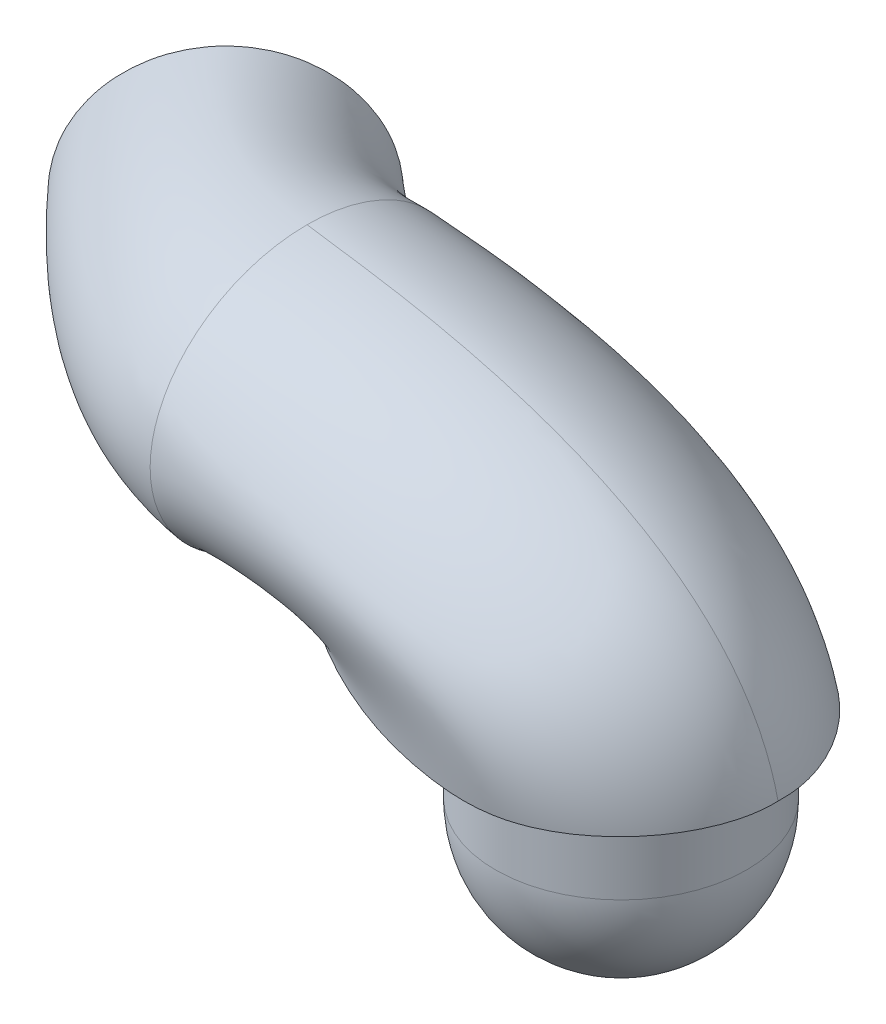
ISO-10303-21;
HEADER;
FILE_DESCRIPTION(('STEP AP214'),'2;1');
FILE_NAME('part.step','',(''),(''),'','','');
FILE_SCHEMA(('AUTOMOTIVE_DESIGN { 1 0 10303 214 1 1 1 1 }'));
ENDSEC;
DATA;
#1=APPLICATION_CONTEXT('core data for automotive mechanical design processes');
#2=APPLICATION_PROTOCOL_DEFINITION('international standard','automotive_design',2000,#1);
#3=PRODUCT_CONTEXT('',#1,'mechanical');
#4=PRODUCT('Part','Part','',(#3));
#5=PRODUCT_RELATED_PRODUCT_CATEGORY('part','',(#4));
#6=PRODUCT_DEFINITION_FORMATION('','',#4);
#7=PRODUCT_DEFINITION_CONTEXT('part definition',#1,'design');
#8=PRODUCT_DEFINITION('design','',#6,#7);
#9=PRODUCT_DEFINITION_SHAPE('','',#8);
#10=(LENGTH_UNIT() NAMED_UNIT(*) SI_UNIT(.MILLI.,.METRE.));
#11=(NAMED_UNIT(*) PLANE_ANGLE_UNIT() SI_UNIT($,.RADIAN.));
#12=(NAMED_UNIT(*) SI_UNIT($,.STERADIAN.) SOLID_ANGLE_UNIT());
#13=UNCERTAINTY_MEASURE_WITH_UNIT(LENGTH_MEASURE(1.E-05),#10,'distance_accuracy_value','');
#14=(GEOMETRIC_REPRESENTATION_CONTEXT(3) GLOBAL_UNCERTAINTY_ASSIGNED_CONTEXT((#13)) GLOBAL_UNIT_ASSIGNED_CONTEXT((#10,
#11,#12)) REPRESENTATION_CONTEXT('',''));
#15=CARTESIAN_POINT('',(0.,0.,0.));
#16=DIRECTION('',(0.,0.,1.));
#17=DIRECTION('',(1.,0.,0.));
#18=AXIS2_PLACEMENT_3D('',#15,#16,#17);
#19=CARTESIAN_POINT('',(4.73507473245652,0.,4.98936116941505));
#20=DIRECTION('',(0.,-1.,0.));
#21=DIRECTION('',(0.,0.,-1.));
#22=AXIS2_PLACEMENT_3D('',#19,#20,#21);
#23=PLANE('',#22);
#24=CARTESIAN_POINT('',(5.,0.,2.5));
#25=DIRECTION('',(0.,-1.,0.));
#26=DIRECTION('',(0.,0.,-1.));
#27=AXIS2_PLACEMENT_3D('',#24,#25,#26);
#28=CIRCLE('',#27,2.);
#29=CARTESIAN_POINT('',(3.06350832689629,0.,2.));
#30=VERTEX_POINT('',#29);
#31=CARTESIAN_POINT('',(3.06350832689629,0.,3.));
#32=VERTEX_POINT('',#31);
#33=EDGE_CURVE('E239',#30,#32,#28,.T.);
#34=ORIENTED_EDGE('',*,*,#33,.F.);
#35=DIRECTION('',(-1.,0.,0.));
#36=VECTOR('',#35,1.);
#37=CARTESIAN_POINT('',(4.44098300562505,0.,2.));
#38=LINE('',#37,#36);
#39=CARTESIAN_POINT('',(4.44098300562505,0.,2.));
#40=VERTEX_POINT('',#39);
#41=EDGE_CURVE('E219',#40,#30,#38,.T.);
#42=ORIENTED_EDGE('',*,*,#41,.F.);
#43=CARTESIAN_POINT('',(5.,0.,2.5));
#44=DIRECTION('',(0.,1.,0.));
#45=DIRECTION('',(0.,0.,1.));
#46=AXIS2_PLACEMENT_3D('',#43,#44,#45);
#47=CIRCLE('',#46,0.75);
#48=CARTESIAN_POINT('',(4.44098300562505,0.,3.));
#49=VERTEX_POINT('',#48);
#50=EDGE_CURVE('E214',#49,#40,#47,.T.);
#51=ORIENTED_EDGE('',*,*,#50,.F.);
#52=DIRECTION('',(1.,0.,0.));
#53=VECTOR('',#52,1.);
#54=CARTESIAN_POINT('',(2.6790228958727,0.,3.));
#55=LINE('',#54,#53);
#56=EDGE_CURVE('E222',#32,#49,#55,.T.);
#57=ORIENTED_EDGE('',*,*,#56,.F.);
#58=EDGE_LOOP('',(#34,#42,#51,#57));
#59=FACE_BOUND('',#58,.T.);
#60=CARTESIAN_POINT('',(0.,0.,2.5));
#61=CARTESIAN_POINT('',(0.293338087820461,0.,2.82795129944699));
#62=CARTESIAN_POINT('',(0.969478991949337,0.,3.47175607058277));
#63=CARTESIAN_POINT('',(2.0225358724664,0.,4.15441549125842));
#64=CARTESIAN_POINT('',(2.93444095803466,0.,4.56768487752718));
#65=CARTESIAN_POINT('',(3.63304559323961,0.,4.80332689979681));
#66=CARTESIAN_POINT('',(4.32877073926575,0.,4.95378775654363));
#67=CARTESIAN_POINT('',(4.78000040421905,0.,5.));
#68=CARTESIAN_POINT('',(5.1817895453393,0.,5.));
#69=CARTESIAN_POINT('',(5.52857314560845,0.,4.96506001367999));
#70=CARTESIAN_POINT('',(5.99170763089045,0.,4.79874490778828));
#71=CARTESIAN_POINT('',(6.39822178057757,0.,4.55577936255793));
#72=CARTESIAN_POINT('',(6.86621771406725,0.,4.14920933028272));
#73=CARTESIAN_POINT('',(7.23330123988562,0.,3.64143178730474));
#74=CARTESIAN_POINT('',(7.46344380636916,0.,3.02850424136115));
#75=CARTESIAN_POINT('',(7.50823058996346,0.,2.68160312823165));
#76=CARTESIAN_POINT('',(7.5,0.,2.49999999999999));
#77=B_SPLINE_CURVE_WITH_KNOTS('',3,(#60,#61,#62,#63,#64,#65,#66,#67,#68,#69,#70,#71,#72,#73,#74,
#75,#76),.UNSPECIFIED.,.F.,.F.,(4,1,1,1,1,1,2,1,1,1,1,1,1,4),(0.,0.136887448758295,
0.273774897516589,0.342218621895737,0.410662346274884,0.479106070654031,0.547549795033178,
0.604106070654031,0.660662346274884,0.717218621895737,0.773774897516589,0.886887448758295,
0.943443724379147,1.),.UNSPECIFIED.);
#78=CARTESIAN_POINT('',(0.,-1.2928250840123E-08,2.49971507284762));
#79=VERTEX_POINT('',#78);
#80=CARTESIAN_POINT('',(7.5,0.,2.5));
#81=VERTEX_POINT('',#80);
#82=EDGE_CURVE('E251',#79,#81,#77,.T.);
#83=ORIENTED_EDGE('',*,*,#82,.F.);
#84=CARTESIAN_POINT('',(7.5,0.,2.50000000000001));
#85=CARTESIAN_POINT('',(7.50823058917349,0.,2.31839688919857));
#86=CARTESIAN_POINT('',(7.46344381568126,0.,1.97149579834312));
#87=CARTESIAN_POINT('',(7.23330125921473,0.,1.35856824306579));
#88=CARTESIAN_POINT('',(6.86621772138046,0.,0.850790673414314));
#89=CARTESIAN_POINT('',(6.39822176321519,0.,0.444220623691196));
#90=CARTESIAN_POINT('',(5.99170759816834,0.,0.201255075385112));
#91=CARTESIAN_POINT('',(5.52857310613618,0.,0.0349399784608431));
#92=CARTESIAN_POINT('',(5.18178952789119,0.,0.));
#93=CARTESIAN_POINT('',(4.78000039221216,0.,0.));
#94=CARTESIAN_POINT('',(4.3287706849955,0.,0.0462122499199591));
#95=CARTESIAN_POINT('',(3.63304553826115,0.,0.196673117505334));
#96=CARTESIAN_POINT('',(2.93444092301905,0.,0.432315135350582));
#97=CARTESIAN_POINT('',(2.0225358825626,0.,0.845584510287323));
#98=CARTESIAN_POINT('',(0.96947906081587,0.,1.52824387361764));
#99=CARTESIAN_POINT('',(0.293338103829924,0.,2.17204868265447));
#100=CARTESIAN_POINT('',(0.,0.,2.5));
#101=B_SPLINE_CURVE_WITH_KNOTS('',3,(#84,#85,#86,#87,#88,#89,#90,#91,#92,#93,#94,#95,#96,#97,
#98,#99,#100),.UNSPECIFIED.,.F.,.F.,(4,1,1,1,1,1,1,2,1,1,1,1,1,4),(0.,0.0565562694304325,
0.113112538860865,0.226225077721729,0.282781347152162,0.339337616582594,0.395893886013026,
0.452450155443459,0.520893886013026,0.589337616582594,0.657781347152162,0.726225077721729,
0.863112538860865,1.),.UNSPECIFIED.);
#102=EDGE_CURVE('E245',#81,#79,#101,.T.);
#103=ORIENTED_EDGE('',*,*,#102,.F.);
#104=EDGE_LOOP('',(#83,#103));
#105=FACE_BOUND('',#104,.T.);
#106=ADVANCED_FACE('F154',(#59,#105),#23,.T.);
#107=CARTESIAN_POINT('',(-3.31225624165787,2.,0.483829116911674));
#108=DIRECTION('',(0.707106781186546,0.,0.707106781186549));
#109=DIRECTION('',(0.707106781186549,0.,-0.707106781186546));
#110=AXIS2_PLACEMENT_3D('',#107,#108,#109);
#111=PLANE('',#110);
#112=CARTESIAN_POINT('',(-3.31225624165787,2.,0.483829116911674));
#113=DIRECTION('',(0.707106781186546,0.,0.707106781186549));
#114=DIRECTION('',(-0.707106781186549,0.,0.707106781186546));
#115=AXIS2_PLACEMENT_3D('',#112,#113,#114);
#116=ELLIPSE('',#115,2.,2.);
#117=CARTESIAN_POINT('',(-4.72646980403097,2.,1.89804267928477));
#118=VERTEX_POINT('',#117);
#119=EDGE_CURVE('E382',#118,#118,#116,.T.);
#120=ORIENTED_EDGE('',*,*,#119,.F.);
#121=EDGE_LOOP('',(#120));
#122=FACE_BOUND('',#121,.T.);
#123=CARTESIAN_POINT('',(-3.31225624165787,2.,0.483829116911674));
#124=DIRECTION('',(0.707106781186546,0.,0.707106781186549));
#125=DIRECTION('',(0.707106781186549,0.,-0.707106781186546));
#126=AXIS2_PLACEMENT_3D('',#123,#124,#125);
#127=CIRCLE('',#126,1.125);
#128=CARTESIAN_POINT('',(-2.516761112823,2.,-0.31166601192319));
#129=VERTEX_POINT('',#128);
#130=EDGE_CURVE('E246',#129,#129,#127,.T.);
#131=ORIENTED_EDGE('',*,*,#130,.T.);
#132=EDGE_LOOP('',(#131));
#133=FACE_BOUND('',#132,.T.);
#134=ADVANCED_FACE('F325',(#122,#133),#111,.F.);
#135=CARTESIAN_POINT('',(0.,4.2,2.49999997011014));
#136=CARTESIAN_POINT('',(-0.146742611688297,4.20286550461975,2.48179723035606));
#137=CARTESIAN_POINT('',(-1.12222066506903,4.1789003750892,2.30069532329818));
#138=CARTESIAN_POINT('',(-1.95948753838525,4.17445859906967,2.03247373475735));
#139=CARTESIAN_POINT('',(-3.31225624165787,4.,0.483829116911673));
#140=CARTESIAN_POINT('',(0.,4.2,2.19836129227853));
#141=CARTESIAN_POINT('',(-0.139655756541813,4.20286550461975,2.18406290197288));
#142=CARTESIAN_POINT('',(-1.04755878022122,4.1789003750892,2.04365442456356));
#143=CARTESIAN_POINT('',(-1.82449953616029,4.17445859906967,1.8156706481727));
#144=CARTESIAN_POINT('',(-3.12713612960674,4.,0.298709004860543));
#145=CARTESIAN_POINT('',(0.,4.10833507935549,1.59472909886228));
#146=CARTESIAN_POINT('',(-0.120973982876845,4.11002144089427,1.58594662839158));
#147=CARTESIAN_POINT('',(-0.904573863692059,4.08061234565118,1.50178683907874));
#148=CARTESIAN_POINT('',(-1.55258827534835,4.06638287744619,1.33493326701403));
#149=CARTESIAN_POINT('',(-2.75696375909292,3.89598215796163,-0.0714633656532701));
#150=CARTESIAN_POINT('',(0.,3.69371629660239,0.776500214039875));
#151=CARTESIAN_POINT('',(-0.0893458189282706,3.69209060756782,0.772432772687611));
#152=CARTESIAN_POINT('',(-0.733092205662598,3.64860340188294,0.733123212621852));
#153=CARTESIAN_POINT('',(-1.20291843988814,3.6072646438174,0.627302127550897));
#154=CARTESIAN_POINT('',(-2.2861976535332,3.45106597111442,-0.542229471213002));
#155=CARTESIAN_POINT('',(0.,3.00272511026058,0.160766285967962));
#156=CARTESIAN_POINT('',(-0.063610221964274,2.99963819662749,0.159854172326594));
#157=CARTESIAN_POINT('',(-0.623958643141196,2.96058114025006,0.148560376060056));
#158=CARTESIAN_POINT('',(-0.966615544216336,2.91064135207322,0.0872790256589414));
#159=CARTESIAN_POINT('',(-1.97159440075428,2.78530215992626,-0.856832723991904));
#160=CARTESIAN_POINT('',(0.,2.40163870772189,0.));
#161=CARTESIAN_POINT('',(-0.0561900803845833,2.40037053557888,-0.000301631636904407));
#162=CARTESIAN_POINT('',(-0.599911396905172,2.38584835920112,-0.00687602085754774));
#163=CARTESIAN_POINT('',(-0.910444623419121,2.35609972455105,-0.0578730217352386));
#164=CARTESIAN_POINT('',(-1.89804267928477,2.26179937313036,-0.930384445461419));
#165=CARTESIAN_POINT('',(0.,1.7983613221811,0.));
#166=CARTESIAN_POINT('',(-0.0561900803845833,1.79974910381625,-0.000301631636904211));
#167=CARTESIAN_POINT('',(-0.599911396905172,1.81178646522161,-0.00687602085754752));
#168=CARTESIAN_POINT('',(-0.910444623419121,1.80859736835465,-0.0578730217352383));
#169=CARTESIAN_POINT('',(-1.89804267928477,1.73820060093892,-0.930384445461418));
#170=CARTESIAN_POINT('',(0.,1.19727492933299,0.160766259464055));
#171=CARTESIAN_POINT('',(-0.0548917199946969,1.20082468843853,0.162729750023182));
#172=CARTESIAN_POINT('',(-0.593725373143239,1.2347118814175,0.171075370974304));
#173=CARTESIAN_POINT('',(-0.973911339668054,1.25527592340819,0.0503136387346895));
#174=CARTESIAN_POINT('',(-1.97159441350193,1.21469780349391,-0.856832711244266));
#175=CARTESIAN_POINT('',(0.,0.506283697054256,0.776500209636346));
#176=CARTESIAN_POINT('',(-0.054471809498738,0.509401944448522,0.783935180112972));
#177=CARTESIAN_POINT('',(-0.61215910848492,0.539664190919537,0.823183239125599));
#178=CARTESIAN_POINT('',(-1.23210158860519,0.56231320825439,0.479440576925317));
#179=CARTESIAN_POINT('',(-2.28619765696574,0.548934033738167,-0.542229467780446));
#180=CARTESIAN_POINT('',(0.,0.0916649048201302,1.5947291423194));
#181=CARTESIAN_POINT('',(-0.0599444653893786,0.0925008123711799,1.60607588977972));
#182=CARTESIAN_POINT('',(-0.692940932512134,0.100629831013785,1.6593919060208));
#183=CARTESIAN_POINT('',(-1.60365876374493,0.106855542372347,1.07617554618459));
#184=CARTESIAN_POINT('',(-2.75696373322839,0.104017860065657,-0.0714633915178119));
#185=CARTESIAN_POINT('',(0.,0.,2.1983613221807));
#186=CARTESIAN_POINT('',(-0.0699077370469979,0.,2.20706775339796));
#187=CARTESIAN_POINT('',(-0.805692578138338,0.,2.2237744924289));
#188=CARTESIAN_POINT('',(-1.88286581715893,0.,1.51994754016445));
#189=CARTESIAN_POINT('',(-3.12713611127149,0.,0.298708986525293));
#190=CARTESIAN_POINT('',(0.,0.,2.80163870772319));
#191=CARTESIAN_POINT('',(-0.0840814480419639,0.,2.80253643965677));
#192=CARTESIAN_POINT('',(-0.955016355229448,0.,2.73785631535882));
#193=CARTESIAN_POINT('',(-2.15284183497922,0.,1.95355373480779));
#194=CARTESIAN_POINT('',(-3.49737635370901,0.,0.668949228962813));
#195=CARTESIAN_POINT('',(0.,0.0916649206455884,3.4052709011433));
#196=CARTESIAN_POINT('',(-0.0875872606806623,0.0924571178085326,3.40131011932424));
#197=CARTESIAN_POINT('',(-0.977480993420405,0.100186966034652,3.29493919639107));
#198=CARTESIAN_POINT('',(-2.32620520636502,0.107938520074303,2.5310945458628));
#199=CARTESIAN_POINT('',(-3.86754872422255,0.104017842038337,1.03912159947635));
#200=CARTESIAN_POINT('',(0.,0.506283703404131,4.22349978597012));
#201=CARTESIAN_POINT('',(-0.0736875415503121,0.509227113386236,4.21679619327979));
#202=CARTESIAN_POINT('',(-0.787401816434423,0.53789271959392,4.10924870948619));
#203=CARTESIAN_POINT('',(-2.38023137354631,0.566645149055742,3.52913597501362));
#204=CARTESIAN_POINT('',(-4.33831482978188,0.548934028884766,1.50988770503568));
#205=CARTESIAN_POINT('',(0.,1.19727488975452,4.83923371404141));
#206=CARTESIAN_POINT('',(-0.0538952554353766,1.20051868658087,4.83134701188757));
#207=CARTESIAN_POINT('',(-0.534974543940408,1.23161179101987,4.73945743268341));
#208=CARTESIAN_POINT('',(-2.32089060093949,1.26285683615362,4.3595693665924));
#209=CARTESIAN_POINT('',(-4.65291808256107,1.21469784007231,1.82449095781486));
#210=CARTESIAN_POINT('',(0.,1.79836129229778,5.00000000000351));
#211=CARTESIAN_POINT('',(-0.0461394359887617,1.79939940171593,4.99216022192788));
#212=CARTESIAN_POINT('',(-0.438501511838035,1.80824350866791,4.91010912514281));
#213=CARTESIAN_POINT('',(-2.27851363231067,1.81726126212817,4.60152484388083));
#214=CARTESIAN_POINT('',(-4.72646980403097,1.73820062686889,1.89804267928477));
#215=CARTESIAN_POINT('',(0.,2.40163867783856,4.99999999999649));
#216=CARTESIAN_POINT('',(-0.0461394359887617,2.40002083347856,4.99216022192112));
#217=CARTESIAN_POINT('',(-0.438501511838035,2.38230540264743,4.91010912513858));
#218=CARTESIAN_POINT('',(-2.27851363231067,2.36476361832457,4.60152484387891));
#219=CARTESIAN_POINT('',(-4.72646980403097,2.26179939906034,1.89804267928477));
#220=CARTESIAN_POINT('',(0.,3.00272507068211,4.83923374052658));
#221=CARTESIAN_POINT('',(-0.0626137574049408,2.99933219476982,4.82847143417294));
#222=CARTESIAN_POINT('',(-0.565207813938365,2.95748104985242,4.71694243775809));
#223=CARTESIAN_POINT('',(-2.31359480548809,2.91822226481865,4.3965347535121));
#224=CARTESIAN_POINT('',(-4.65291806981422,2.78530219650464,1.82449094506801));
#225=CARTESIAN_POINT('',(0.,3.69371630295224,4.22349979035368));
#226=CARTESIAN_POINT('',(-0.108561550979761,3.69191577650552,4.20529378583522));
#227=CARTESIAN_POINT('',(-0.908334913611638,3.64683193055731,4.01918868297089));
#228=CARTESIAN_POINT('',(-2.35104822482944,3.61159658461875,3.67699752563491));
#229=CARTESIAN_POINT('',(-4.33831482635066,3.45106596626102,1.50988770160447));
#230=CARTESIAN_POINT('',(0.,4.10833509518095,3.40527085767503));
#231=CARTESIAN_POINT('',(-0.148616778167991,4.10997774633162,3.38118085792536));
#232=CARTESIAN_POINT('',(-1.18911392459937,4.08016948067204,3.13733412944258));
#233=CARTESIAN_POINT('',(-2.2751347179679,4.06746585514814,2.78985226668994));
#234=CARTESIAN_POINT('',(-3.86754875008765,3.8959821399343,1.03912162534144));
#235=CARTESIAN_POINT('',(0.,4.2,2.80163867781761));
#236=CARTESIAN_POINT('',(-0.1538294675367,4.20286550461975,2.77953158822839));
#237=CARTESIAN_POINT('',(-1.19688255731175,4.1789003750892,2.55773624749147));
#238=CARTESIAN_POINT('',(-2.09447555398012,4.17445859906967,2.2492768428153));
#239=CARTESIAN_POINT('',(-3.49737637204426,4.,0.668949247298062));
#240=CARTESIAN_POINT('',(0.,4.2,2.49999997011014));
#241=CARTESIAN_POINT('',(-0.146742611688297,4.20286550461975,2.48179723035606));
#242=CARTESIAN_POINT('',(-1.12222066506903,4.1789003750892,2.30069532329818));
#243=CARTESIAN_POINT('',(-1.95948753838525,4.17445859906967,2.03247373475735));
#244=CARTESIAN_POINT('',(-3.31225624165787,4.,0.483829116911673));
#245=B_SPLINE_SURFACE_WITH_KNOTS('',3,3,((#135,#136,#137,#138,#139),(#140,#141,#142,#143,#144),
(#145,#146,#147,#148,#149),(#150,#151,#152,#153,#154),(#155,#156,#157,#158,#159),(#160,#161,
#162,#163,#164),(#165,#166,#167,#168,#169),(#170,#171,#172,#173,#174),(#175,#176,#177,#178,
#179),(#180,#181,#182,#183,#184),(#185,#186,#187,#188,#189),(#190,#191,#192,#193,#194),(#195,
#196,#197,#198,#199),(#200,#201,#202,#203,#204),(#205,#206,#207,#208,#209),(#210,#211,#212,#213,
#214),(#215,#216,#217,#218,#219),(#220,#221,#222,#223,#224),(#225,#226,#227,#228,#229),(#230,
#231,#232,#233,#234),(#235,#236,#237,#238,#239),(#240,#241,#242,#243,#244)),.UNSPECIFIED.,.T.,
.F.,.F.,(4,1,1,1,2,1,1,1,2,1,1,1,2,1,1,1,4),(4,1,4),(0.,0.0624999969047489,0.124999993809498,
0.187499990714247,0.249999987618996,0.312499990714247,0.374999993809498,0.437499996904749,
0.500000000000001,0.562499996904927,0.624999993809853,0.687499990714779,0.749999987619705,
0.812499990714778,0.874999993809852,0.937499996904926,1.),(0.,0.0999999999941863,1.),.UNSPECIFIED.);
#246=CARTESIAN_POINT('',(0.,2.1,2.5));
#247=DIRECTION('',(1.,0.,0.));
#248=DIRECTION('',(0.,0.,-1.));
#249=AXIS2_PLACEMENT_3D('',#246,#247,#248);
#250=ELLIPSE('',#249,2.5,2.1);
#251=CARTESIAN_POINT('',(0.,4.2,2.49999998505507));
#252=VERTEX_POINT('',#251);
#253=EDGE_CURVE('E183',#252,#79,#250,.T.);
#254=CARTESIAN_POINT('',(0.,0.,2.50000000001222));
#255=CARTESIAN_POINT('',(0.,-1.35784116987904E-12,2.16967559403792));
#256=CARTESIAN_POINT('',(0.,0.105883210677071,1.55884618883736));
#257=CARTESIAN_POINT('',(0.,0.443578776925178,0.909399669526774));
#258=CARTESIAN_POINT('',(0.,0.837871906372763,0.481899893110981));
#259=CARTESIAN_POINT('',(0.,1.19638423191904,0.22413777234123));
#260=CARTESIAN_POINT('',(0.,1.61841317616196,0.0460723551393264));
#261=CARTESIAN_POINT('',(0.,1.93483779701285,0.));
#262=CARTESIAN_POINT('',(0.,2.23647648694374,0.));
#263=CARTESIAN_POINT('',(0.,2.51924998343517,0.0332371478353647));
#264=CARTESIAN_POINT('',(0.,2.94130300614817,0.187749965087625));
#265=CARTESIAN_POINT('',(0.,3.329680017001,0.451865529832219));
#266=CARTESIAN_POINT('',(0.,3.77181354724044,0.916256667810958));
#267=CARTESIAN_POINT('',(0.,4.05419164850725,1.49815346576288));
#268=CARTESIAN_POINT('',(0.,4.18119654345599,2.08119218589711));
#269=CARTESIAN_POINT('',(0.,4.2,2.36352351305626));
#270=CARTESIAN_POINT('',(0.,4.2,2.5));
#271=B_SPLINE_CURVE_WITH_KNOTS('',3,(#254,#255,#256,#257,#258,#259,#260,#261,#262,#263,#264,
#265,#266,#267,#268,#269,#270),.UNSPECIFIED.,.F.,.F.,(4,1,1,1,1,1,2,1,1,1,1,1,1,4),(0.,
0.136887461139135,0.273774922278271,0.342218652847838,0.410662383417406,0.479106113986974,
0.547549844556541,0.604106113986974,0.660662383417406,0.717218652847838,0.773774922278271,
0.886887461139135,0.943443730569568,1.),.UNSPECIFIED.);
#272=EDGE_CURVE('E306',#79,#252,#271,.T.);
#273=ORIENTED_EDGE('',*,*,#253,.F.);
#274=ORIENTED_EDGE('',*,*,#272,.F.);
#275=EDGE_LOOP('',(#273,#274));
#276=FACE_BOUND('',#275,.T.);
#277=ORIENTED_EDGE('',*,*,#119,.T.);
#278=EDGE_LOOP('',(#277));
#279=FACE_BOUND('',#278,.T.);
#280=ADVANCED_FACE('F272',(#276,#279),#245,.T.);
#281=CARTESIAN_POINT('',(0.,4.2,2.5));
#282=CARTESIAN_POINT('',(0.105781777957206,4.1979343547867,2.51312176002954));
#283=CARTESIAN_POINT('',(1.4192393709244,4.14993393507288,2.64482044491097));
#284=CARTESIAN_POINT('',(7.08014247247718,3.62406705762578,2.81743268927057));
#285=CARTESIAN_POINT('',(7.5,0.,2.49999999999999));
#286=CARTESIAN_POINT('',(0.,4.2,2.63647647485788));
#287=CARTESIAN_POINT('',(0.106056130955982,4.1979343547867,2.65110245666651));
#288=CARTESIAN_POINT('',(1.42225725391099,4.14993393507288,2.7978433593392));
#289=CARTESIAN_POINT('',(7.08590388545159,3.62406705762578,2.98549782149005));
#290=CARTESIAN_POINT('',(7.50823058996346,0.,2.68160312823165));
#291=CARTESIAN_POINT('',(0.,4.18119654722982,2.91880778398276));
#292=CARTESIAN_POINT('',(0.105062778304238,4.17765981231065,2.93544418715239));
#293=CARTESIAN_POINT('',(1.40708209944928,4.11758558032943,3.10213750174085));
#294=CARTESIAN_POINT('',(7.03864678014114,3.59229630136862,3.31488341729668));
#295=CARTESIAN_POINT('',(7.46344380636916,0.,3.02850424136115));
#296=CARTESIAN_POINT('',(0.,4.0541916623502,3.5018464952999));
#297=CARTESIAN_POINT('',(0.100077603236646,4.04439148571377,3.5187696657616));
#298=CARTESIAN_POINT('',(1.33042573047503,3.9339482010934,3.68757164479663));
#299=CARTESIAN_POINT('',(6.79856320373426,3.42208185181585,3.92812143224515));
#300=CARTESIAN_POINT('',(7.23330123988562,0.,3.64143178730474));
#301=CARTESIAN_POINT('',(0.,3.77181355607381,4.08374332936444));
#302=CARTESIAN_POINT('',(0.0925919793533299,3.75461268903872,4.09706061327724));
#303=CARTESIAN_POINT('',(1.21178539834615,3.58757894107068,4.22858931326387));
#304=CARTESIAN_POINT('',(6.41654589772116,3.12247312869072,4.47297815357775));
#305=CARTESIAN_POINT('',(6.86621771406725,0.,4.14920933028272));
#306=CARTESIAN_POINT('',(0.,3.3296799989235,4.5481344861156));
#307=CARTESIAN_POINT('',(0.0828738673968581,3.31035813985225,4.55838915569983));
#308=CARTESIAN_POINT('',(1.06511929680365,3.13401055562439,4.65807729884168));
#309=CARTESIAN_POINT('',(5.96717793096125,2.76615147855342,4.91173791422447));
#310=CARTESIAN_POINT('',(6.39822178057757,0.,4.55577936255793));
#311=CARTESIAN_POINT('',(0.,2.94130297249896,4.81225005335053));
#312=CARTESIAN_POINT('',(0.0740670917902432,2.92382790786801,4.82105471864605));
#313=CARTESIAN_POINT('',(0.939438068703537,2.76944229469017,4.90544586000282));
#314=CARTESIAN_POINT('',(5.60527469917771,2.49598304135778,5.17078944141887));
#315=CARTESIAN_POINT('',(5.99170763089045,0.,4.79874490778828));
#316=CARTESIAN_POINT('',(0.,2.51924995438778,4.96676285858527));
#317=CARTESIAN_POINT('',(0.0634721055986542,2.50785691195072,4.97542878850609));
#318=CARTESIAN_POINT('',(0.797857636650451,2.40968965276874,5.05786331976034));
#319=CARTESIAN_POINT('',(5.23006278613679,2.24831666848286,5.34052169665837));
#320=CARTESIAN_POINT('',(5.52857314560845,0.,4.96506001367999));
#321=CARTESIAN_POINT('',(0.,2.2364764748784,4.99999999999841));
#322=CARTESIAN_POINT('',(0.0550517963726515,2.23230521584915,5.00858078597704));
#323=CARTESIAN_POINT('',(0.692893025117255,2.1961120436159,5.09001207611462));
#324=CARTESIAN_POINT('',(4.97907996660789,2.11685355678739,5.37680625338512));
#325=CARTESIAN_POINT('',(5.1817895453393,0.,5.));
#326=CARTESIAN_POINT('',(0.,1.9348377792685,5.00000000000192));
#327=CARTESIAN_POINT('',(0.044992551267927,1.9405871078049,5.00858078598043));
#328=CARTESIAN_POINT('',(0.572020239230303,1.98733177708318,5.09001207611705));
#329=CARTESIAN_POINT('',(4.70751710444612,2.00046947300333,5.37680625338648));
#330=CARTESIAN_POINT('',(4.78000040421905,0.,5.));
#331=CARTESIAN_POINT('',(0.,1.61841314093148,4.9539276381165));
#332=CARTESIAN_POINT('',(0.0363198271575806,1.63240245463583,4.96223561181415));
#333=CARTESIAN_POINT('',(0.465641105292898,1.74824317049256,5.04107554694384));
#334=CARTESIAN_POINT('',(4.35723299098797,1.83945734114242,5.31886077898333));
#335=CARTESIAN_POINT('',(4.32877073926575,0.,4.95378775654363));
#336=CARTESIAN_POINT('',(0.,1.19638420218133,4.77586220881276));
#337=CARTESIAN_POINT('',(0.0286246370795253,1.21612515248439,4.78408477407209));
#338=CARTESIAN_POINT('',(0.365531308959529,1.38051206326045,4.86258350407459));
#339=CARTESIAN_POINT('',(3.71676567576151,1.53015840369539,5.11596156765095));
#340=CARTESIAN_POINT('',(3.63304559323961,0.,4.80332689979681));
#341=CARTESIAN_POINT('',(0.,0.83787189144089,4.51810009222563));
#342=CARTESIAN_POINT('',(0.0245674587476029,0.858019937620774,4.52565220876259));
#343=CARTESIAN_POINT('',(0.306809909689242,1.02594477199833,4.59816448249947));
#344=CARTESIAN_POINT('',(3.00573640278804,1.18597786855907,4.81186374113997));
#345=CARTESIAN_POINT('',(2.93444095803466,0.,4.56768487752718));
#346=CARTESIAN_POINT('',(0.,0.443578783461024,4.09060033484364));
#347=CARTESIAN_POINT('',(0.0218431308798902,0.45934564853407,4.09648160058971));
#348=CARTESIAN_POINT('',(0.260365037119713,0.590599605245449,4.15337950882997));
#349=CARTESIAN_POINT('',(2.02437088562114,0.71977411107667,4.30012368019067));
#350=CARTESIAN_POINT('',(2.0225358724664,0.,4.15441549125842));
#351=CARTESIAN_POINT('',(0.,0.105883227239584,3.44115384907783));
#352=CARTESIAN_POINT('',(0.0196205754473538,0.11107005919907,3.4432465213753));
#353=CARTESIAN_POINT('',(0.220567115695064,0.15380068786667,3.4636261731442));
#354=CARTESIAN_POINT('',(0.853467212868302,0.196861993569539,3.50967618580465));
#355=CARTESIAN_POINT('',(0.969478991949337,0.,3.47175607058277));
#356=CARTESIAN_POINT('',(0.,1.35437186879012E-12,2.83032444151626));
#357=CARTESIAN_POINT('',(0.00977793626044747,1.30922613983153E-12,2.83024533678062));
#358=CARTESIAN_POINT('',(0.107557298867268,8.57768850234826E-13,2.8294542894242));
#359=CARTESIAN_POINT('',(0.205336661474088,4.06311560638119E-13,2.82866324206778));
#360=CARTESIAN_POINT('',(0.293338087820461,0.,2.82795129944699));
#361=CARTESIAN_POINT('',(0.,0.,2.50000000001222));
#362=CARTESIAN_POINT('',(0.,0.,2.50000000001181));
#363=CARTESIAN_POINT('',(0.,0.,2.50000000000774));
#364=CARTESIAN_POINT('',(0.,0.,2.50000000000367));
#365=CARTESIAN_POINT('',(0.,0.,2.5));
#366=B_SPLINE_SURFACE_WITH_KNOTS('',3,3,((#281,#282,#283,#284,#285),(#286,#287,#288,#289,#290),
(#291,#292,#293,#294,#295),(#296,#297,#298,#299,#300),(#301,#302,#303,#304,#305),(#306,#307,
#308,#309,#310),(#311,#312,#313,#314,#315),(#316,#317,#318,#319,#320),(#321,#322,#323,#324,
#325),(#326,#327,#328,#329,#330),(#331,#332,#333,#334,#335),(#336,#337,#338,#339,#340),(#341,
#342,#343,#344,#345),(#346,#347,#348,#349,#350),(#351,#352,#353,#354,#355),(#356,#357,#358,#359,
#360),(#361,#362,#363,#364,#365)),.UNSPECIFIED.,.F.,.F.,.F.,(4,1,1,1,1,1,1,2,1,1,1,1,1,4),(4,1,
4),(0.,0.0565562756208527,0.113112551241705,0.226225102483411,0.282781378104263,
0.339337653725116,0.395893929345969,0.452450204966821,0.520893929345969,0.589337653725116,
0.657781378104263,0.726225102483411,0.863112551241705,1.),(0.,0.099999999997601,1.),.UNSPECIFIED.);
#367=CARTESIAN_POINT('',(0.,4.2,2.5));
#368=CARTESIAN_POINT('',(0.105781777957206,4.1979343547867,2.51312176002954));
#369=CARTESIAN_POINT('',(1.4192393709244,4.14993393507288,2.64482044491097));
#370=CARTESIAN_POINT('',(7.08014247247718,3.62406705762578,2.81743268927057));
#371=CARTESIAN_POINT('',(7.5,0.,2.49999999999999));
#372=B_SPLINE_CURVE_WITH_KNOTS('',3,(#367,#368,#369,#370,#371),.UNSPECIFIED.,.F.,.F.,(4,1,4),
(0.,0.099999999997601,1.),.UNSPECIFIED.);
#373=EDGE_CURVE('E257',#81,#252,#372,.F.);
#374=ORIENTED_EDGE('',*,*,#253,.T.);
#375=ORIENTED_EDGE('',*,*,#82,.T.);
#376=ORIENTED_EDGE('',*,*,#373,.T.);
#377=EDGE_LOOP('',(#374,#375,#376));
#378=FACE_BOUND('',#377,.T.);
#379=ADVANCED_FACE('F259',(#378),#366,.T.);
#380=CARTESIAN_POINT('',(0.,0.,2.50000000001222));
#381=CARTESIAN_POINT('',(0.,0.,2.50000000001181));
#382=CARTESIAN_POINT('',(0.,0.,2.50000000000774));
#383=CARTESIAN_POINT('',(0.,0.,2.50000000000367));
#384=CARTESIAN_POINT('',(0.,0.,2.5));
#385=CARTESIAN_POINT('',(0.,-1.35784116987904E-12,2.16967559403792));
#386=CARTESIAN_POINT('',(0.00977793679409622,-1.31257979755083E-12,2.1697546969918));
#387=CARTESIAN_POINT('',(0.107557304737404,-8.59966074257813E-13,2.17054572653065));
#388=CARTESIAN_POINT('',(0.205336672680712,-4.07352350964799E-13,2.1713367560695));
#389=CARTESIAN_POINT('',(0.293338103829924,0.,2.17204868265447));
#390=CARTESIAN_POINT('',(0.,0.105883210677071,1.55884618883736));
#391=CARTESIAN_POINT('',(0.046785292325549,0.111066176145206,1.55801561838946));
#392=CARTESIAN_POINT('',(0.572045512421883,0.157083105562118,1.53847420968181));
#393=CARTESIAN_POINT('',(0.855681494149333,0.0944834771617563,1.54691139181567));
#394=CARTESIAN_POINT('',(0.96947906081587,0.,1.52824387361764));
#395=CARTESIAN_POINT('',(0.,0.443578776925178,0.909399669526774));
#396=CARTESIAN_POINT('',(0.118060495464086,0.459286238078528,0.907935771093408));
#397=CARTESIAN_POINT('',(1.49959098903694,0.596016311185912,0.85397182195981));
#398=CARTESIAN_POINT('',(2.0354366483187,0.352588431932835,0.897932940771528));
#399=CARTESIAN_POINT('',(2.0225358825626,0.,0.845584510287323));
#400=CARTESIAN_POINT('',(0.,0.837871906372763,0.481899893110981));
#401=CARTESIAN_POINT('',(0.177395977410163,0.857861074859413,0.481289354845704));
#402=CARTESIAN_POINT('',(2.26709588411725,1.02578277076948,0.413387598936296));
#403=CARTESIAN_POINT('',(3.02786247979548,0.596313398684526,0.499368092655243));
#404=CARTESIAN_POINT('',(2.93444092301905,0.,0.432315135350582));
#405=CARTESIAN_POINT('',(0.,1.19638423191904,0.22413777234123));
#406=CARTESIAN_POINT('',(0.21967378518528,1.21585802219838,0.224513298418046));
#407=CARTESIAN_POINT('',(2.80749884674256,1.37099673412393,0.151725324129972));
#408=CARTESIAN_POINT('',(3.74925878441183,0.786185145919294,0.269541499949746));
#409=CARTESIAN_POINT('',(3.63304553826115,0.,0.196673117505334));
#410=CARTESIAN_POINT('',(0.,1.61841317616196,0.0460723551393264));
#411=CARTESIAN_POINT('',(0.256429614314635,1.63198721542682,0.0475456954256924));
#412=CARTESIAN_POINT('',(3.26563230795206,1.72267898726967,-0.0247976094808016));
#413=CARTESIAN_POINT('',(4.40224715423063,0.971592436028647,0.119693164634476));
#414=CARTESIAN_POINT('',(4.3287706849955,0.,0.0462122499199591));
#415=CARTESIAN_POINT('',(0.,1.93483779701285,0.));
#416=CARTESIAN_POINT('',(0.276000521252724,1.94000314666729,0.00151605380852825));
#417=CARTESIAN_POINT('',(3.49230648803502,1.94049048789804,-0.0732090419334468));
#418=CARTESIAN_POINT('',(4.76485632158209,1.07504865031333,0.0758945890567297));
#419=CARTESIAN_POINT('',(4.78000039221216,0.,0.));
#420=CARTESIAN_POINT('',(0.,2.23647648694374,0.));
#421=CARTESIAN_POINT('',(0.287726820815638,2.23165899465473,0.00151605380852815));
#422=CARTESIAN_POINT('',(3.62669733795138,2.14083650746977,-0.0732090419334468));
#423=CARTESIAN_POINT('',(5.04156696674174,1.1785998910989,0.0758945890567297));
#424=CARTESIAN_POINT('',(5.18178952789119,0.,0.));
#425=CARTESIAN_POINT('',(0.,2.51924998343517,0.0332371478353647));
#426=CARTESIAN_POINT('',(0.288145346486386,2.50725818880678,0.0351726409841473));
#427=CARTESIAN_POINT('',(3.63405544016288,2.35983830924957,-0.0325341014048534));
#428=CARTESIAN_POINT('',(5.2883407204123,1.34500820980156,0.11787178396161));
#429=CARTESIAN_POINT('',(5.52857310613618,0.,0.0349399784608431));
#430=CARTESIAN_POINT('',(0.,2.94130300614817,0.187749965087625));
#431=CARTESIAN_POINT('',(0.27156211833572,2.92330161874752,0.191438911256574));
#432=CARTESIAN_POINT('',(3.43254743068835,2.72562135964373,0.151856548883381));
#433=CARTESIAN_POINT('',(5.65650288535986,1.70194576796108,0.308951443103076));
#434=CARTESIAN_POINT('',(5.99170759816834,0.,0.201255075385112));
#435=CARTESIAN_POINT('',(0.,3.329680017001,0.451865529832219));
#436=CARTESIAN_POINT('',(0.242319393842105,3.30993323709266,0.456753536630118));
#437=CARTESIAN_POINT('',(3.07790484107416,3.09863217963631,0.44398757028595));
#438=CARTESIAN_POINT('',(6.00853647330363,2.12509385963931,0.597889340907061));
#439=CARTESIAN_POINT('',(6.39822176321519,0.,0.444220623691196));
#440=CARTESIAN_POINT('',(0.,3.77181354724044,0.916256667810958));
#441=CARTESIAN_POINT('',(0.194057315067782,3.75434227671062,0.922118731555636));
#442=CARTESIAN_POINT('',(2.49264893398438,3.56506541571868,0.941685014282112));
#443=CARTESIAN_POINT('',(6.44286498324603,2.71452736438814,1.08219024216037));
#444=CARTESIAN_POINT('',(6.86621772138046,0.,0.850790673414314));
#445=CARTESIAN_POINT('',(0.,4.05419164850725,1.49815346576288));
#446=CARTESIAN_POINT('',(0.143562747677172,4.04427558499313,1.50444631511952));
#447=CARTESIAN_POINT('',(1.87936725187107,3.92429954088102,1.55091213356837));
#448=CARTESIAN_POINT('',(6.80984282322108,3.2472479496332,1.6725881053555));
#449=CARTESIAN_POINT('',(7.23330125921473,0.,1.35856824306579));
#450=CARTESIAN_POINT('',(0.,4.18119654345599,2.08119218589711));
#451=CARTESIAN_POINT('',(0.112310302584043,4.17764049410596,2.09029472135553));
#452=CARTESIAN_POINT('',(1.49857235527539,4.11597746934756,2.17897720057448));
#453=CARTESIAN_POINT('',(7.04052672099565,3.56315731720545,2.31428933824828));
#454=CARTESIAN_POINT('',(7.46344381568126,0.,1.97149579834312));
#455=CARTESIAN_POINT('',(0.,4.2,2.36352351305626));
#456=CARTESIAN_POINT('',(0.106056130929649,4.1979343547867,2.37514105229058));
#457=CARTESIAN_POINT('',(1.42225725362134,4.14993393507288,2.49179752921945));
#458=CARTESIAN_POINT('',(7.08590388489862,3.62406705762578,2.64936756562648));
#459=CARTESIAN_POINT('',(7.50823058917349,0.,2.31839688919857));
#460=CARTESIAN_POINT('',(0.,4.2,2.5));
#461=CARTESIAN_POINT('',(0.105781777957206,4.1979343547867,2.51312176002954));
#462=CARTESIAN_POINT('',(1.4192393709244,4.14993393507288,2.64482044491097));
#463=CARTESIAN_POINT('',(7.08014247247718,3.62406705762578,2.81743268927057));
#464=CARTESIAN_POINT('',(7.5,0.,2.50000000000001));
#465=B_SPLINE_SURFACE_WITH_KNOTS('',3,3,((#380,#381,#382,#383,#384),(#385,#386,#387,#388,#389),
(#390,#391,#392,#393,#394),(#395,#396,#397,#398,#399),(#400,#401,#402,#403,#404),(#405,#406,
#407,#408,#409),(#410,#411,#412,#413,#414),(#415,#416,#417,#418,#419),(#420,#421,#422,#423,
#424),(#425,#426,#427,#428,#429),(#430,#431,#432,#433,#434),(#435,#436,#437,#438,#439),(#440,
#441,#442,#443,#444),(#445,#446,#447,#448,#449),(#450,#451,#452,#453,#454),(#455,#456,#457,#458,
#459),(#460,#461,#462,#463,#464)),.UNSPECIFIED.,.F.,.F.,.F.,(4,1,1,1,1,1,2,1,1,1,1,1,1,4),(4,1,
4),(0.,0.136887461139135,0.273774922278271,0.342218652847838,0.410662383417406,
0.479106113986974,0.547549844556541,0.604106113986974,0.660662383417406,0.717218652847838,
0.773774922278271,0.886887461139135,0.943443730569568,1.),(0.,0.099999999997601,1.),.UNSPECIFIED.);
#466=ORIENTED_EDGE('',*,*,#102,.T.);
#467=ORIENTED_EDGE('',*,*,#272,.T.);
#468=ORIENTED_EDGE('',*,*,#373,.F.);
#469=EDGE_LOOP('',(#466,#467,#468));
#470=FACE_BOUND('',#469,.T.);
#471=ADVANCED_FACE('F271',(#470),#465,.T.);
#472=CARTESIAN_POINT('',(0.22327766427486,2.,4.01936302284442));
#473=DIRECTION('',(-0.707106781186546,0.,-0.707106781186549));
#474=DIRECTION('',(-0.707106781186549,0.,0.707106781186546));
#475=AXIS2_PLACEMENT_3D('',#472,#473,#474);
#476=CYLINDRICAL_SURFACE('',#475,1.125);
#477=CARTESIAN_POINT('',(0.22327766427486,2.,4.01936302284442));
#478=DIRECTION('',(0.707106781186546,0.,0.707106781186549));
#479=DIRECTION('',(0.707106781186549,0.,-0.707106781186546));
#480=AXIS2_PLACEMENT_3D('',#477,#478,#479);
#481=CIRCLE('',#480,1.125);
#482=CARTESIAN_POINT('',(1.01877279310973,2.,3.22386789400955));
#483=VERTEX_POINT('',#482);
#484=EDGE_CURVE('E242',#483,#483,#481,.T.);
#485=ORIENTED_EDGE('',*,*,#484,.T.);
#486=EDGE_LOOP('',(#485));
#487=FACE_BOUND('',#486,.T.);
#488=ORIENTED_EDGE('',*,*,#130,.F.);
#489=EDGE_LOOP('',(#488));
#490=FACE_BOUND('',#489,.T.);
#491=ADVANCED_FACE('F273',(#487,#490),#476,.F.);
#492=CARTESIAN_POINT('',(0.22327766427486,2.,4.01936302284442));
#493=DIRECTION('',(0.707106781186546,0.,0.707106781186549));
#494=DIRECTION('',(0.707106781186549,0.,-0.707106781186546));
#495=AXIS2_PLACEMENT_3D('',#492,#493,#494);
#496=PLANE('',#495);
#497=ORIENTED_EDGE('',*,*,#484,.F.);
#498=EDGE_LOOP('',(#497));
#499=FACE_BOUND('',#498,.T.);
#500=ADVANCED_FACE('F365',(#499),#496,.F.);
#501=CARTESIAN_POINT('',(5.,-1.2,2.5));
#502=DIRECTION('',(0.,1.,0.));
#503=DIRECTION('',(0.,0.,1.));
#504=AXIS2_PLACEMENT_3D('',#501,#502,#503);
#505=CYLINDRICAL_SURFACE('',#504,2.);
#506=CARTESIAN_POINT('',(5.,-1.2,2.5));
#507=DIRECTION('',(0.,-1.,0.));
#508=DIRECTION('',(0.,0.,-1.));
#509=AXIS2_PLACEMENT_3D('',#506,#507,#508);
#510=CIRCLE('',#509,2.);
#511=CARTESIAN_POINT('',(3.06350832689629,-1.2,2.));
#512=VERTEX_POINT('',#511);
#513=CARTESIAN_POINT('',(3.06350832689629,-1.2,3.));
#514=VERTEX_POINT('',#513);
#515=EDGE_CURVE('E241',#512,#514,#510,.T.);
#516=ORIENTED_EDGE('',*,*,#515,.F.);
#517=DIRECTION('',(0.,1.,0.));
#518=VECTOR('',#517,1.);
#519=CARTESIAN_POINT('',(3.06350832689629,-1.2,2.));
#520=LINE('',#519,#518);
#521=EDGE_CURVE('E236',#512,#30,#520,.T.);
#522=ORIENTED_EDGE('',*,*,#521,.T.);
#523=ORIENTED_EDGE('',*,*,#33,.T.);
#524=DIRECTION('',(0.,1.,0.));
#525=VECTOR('',#524,1.);
#526=CARTESIAN_POINT('',(3.06350832689629,-1.2,3.));
#527=LINE('',#526,#525);
#528=EDGE_CURVE('E225',#32,#514,#527,.F.);
#529=ORIENTED_EDGE('',*,*,#528,.T.);
#530=EDGE_LOOP('',(#516,#522,#523,#529));
#531=FACE_BOUND('',#530,.T.);
#532=ADVANCED_FACE('F363',(#531),#505,.T.);
#533=CARTESIAN_POINT('',(5.,-1.2,2.5));
#534=DIRECTION('',(1.,0.,0.));
#535=DIRECTION('',(0.,-1.,0.));
#536=AXIS2_PLACEMENT_3D('',#533,#534,#535);
#537=ELLIPSE('',#536,2.05,2.);
#538=TRIMMED_CURVE('',#537,(PARAMETER_VALUE(0.)),(PARAMETER_VALUE(3.14159265358979)),.T.,.PARAMETER.);
#539=CARTESIAN_POINT('',(5.,0.85,2.5));
#540=DIRECTION('',(0.,-1.,0.));
#541=AXIS1_PLACEMENT('',#539,#540);
#542=SURFACE_OF_REVOLUTION('',#538,#541);
#543=CARTESIAN_POINT('',(3.06350832689629,-1.2,2.));
#544=CARTESIAN_POINT('',(3.06350946834159,-1.25686396617628,2.));
#545=CARTESIAN_POINT('',(3.06589374323526,-1.31370100451783,2.));
#546=CARTESIAN_POINT('',(3.07541068078508,-1.42697614126404,2.));
#547=CARTESIAN_POINT('',(3.08254335647721,-1.48341423857304,2.));
#548=CARTESIAN_POINT('',(3.11102268822971,-1.65152667535835,2.));
#549=CARTESIAN_POINT('',(3.13945071063674,-1.76208676974647,2.));
#550=CARTESIAN_POINT('',(3.21451218475464,-1.97686828507397,2.));
#551=CARTESIAN_POINT('',(3.2611571362937,-2.08108565390319,2.));
#552=CARTESIAN_POINT('',(3.37147077825001,-2.28007051357021,2.));
#553=CARTESIAN_POINT('',(3.4351332972154,-2.37484141311585,2.));
#554=CARTESIAN_POINT('',(3.57699892194588,-2.5510396840421,2.));
#555=CARTESIAN_POINT('',(3.65503171366637,-2.63260424482594,2.));
#556=CARTESIAN_POINT('',(3.82397999244629,-2.78107321405354,2.));
#557=CARTESIAN_POINT('',(3.91488928498424,-2.84798463253046,2.00000000000001));
#558=CARTESIAN_POINT('',(4.07825732969717,-2.947479934106,2.));
#559=CARTESIAN_POINT('',(4.1481429044804,-2.98435168055863,2.));
#560=CARTESIAN_POINT('',(4.29184854448768,-3.04917910130976,2.));
#561=CARTESIAN_POINT('',(4.36566465255853,-3.0771435522961,2.));
#562=CARTESIAN_POINT('',(4.44098300562505,-3.10040086231826,2.));
#563=B_SPLINE_CURVE_WITH_KNOTS('',3,(#543,#544,#545,#546,#547,#548,#549,#550,#551,#552,#553,
#554,#555,#556,#557,#558,#559,#560,#561,#562),.UNSPECIFIED.,.F.,.F.,(4,2,2,2,2,2,2,2,2,4),(0.,
0.170488233992192,0.340976936035052,0.681694818390868,1.02262813480444,1.36343797847533,
1.70044198847065,2.03728442252747,2.27376356003796,2.51000895987336),.UNSPECIFIED.);
#564=CARTESIAN_POINT('',(4.44098300562505,-3.10040086231826,2.));
#565=VERTEX_POINT('',#564);
#566=EDGE_CURVE('E13',#512,#565,#563,.T.);
#567=ORIENTED_EDGE('',*,*,#566,.F.);
#568=ORIENTED_EDGE('',*,*,#515,.T.);
#569=CARTESIAN_POINT('',(4.44098300562505,-3.10040086231826,3.));
#570=CARTESIAN_POINT('',(4.38906807144828,-3.08435686573292,3.));
#571=CARTESIAN_POINT('',(4.33786795377797,-3.06609356179512,3.));
#572=CARTESIAN_POINT('',(4.23721690589062,-3.02527524872801,3.));
#573=CARTESIAN_POINT('',(4.18776570941768,-3.00272089623267,3.));
#574=CARTESIAN_POINT('',(4.04271969627845,-2.92894940261184,3.));
#575=CARTESIAN_POINT('',(3.95018453867766,-2.87154670387721,3.));
#576=CARTESIAN_POINT('',(3.77606980349163,-2.7421316426742,3.));
#577=CARTESIAN_POINT('',(3.6944893437254,-2.67012045780011,2.99999999999999));
#578=CARTESIAN_POINT('',(3.5443201438549,-2.51362309956143,3.00000000000002));
#579=CARTESIAN_POINT('',(3.47573197922587,-2.4291363739053,3.00000000000005));
#580=CARTESIAN_POINT('',(3.35224493728554,-2.24864167922437,3.00000000000005));
#581=CARTESIAN_POINT('',(3.2975909363229,-2.15246643060217,3.00000000000002));
#582=CARTESIAN_POINT('',(3.20478489466075,-1.95243402724304,2.99999999999999));
#583=CARTESIAN_POINT('',(3.16663520188719,-1.84857578197162,3.));
#584=CARTESIAN_POINT('',(3.11274168285613,-1.65409565864978,3.));
#585=CARTESIAN_POINT('',(3.09429788333131,-1.56420998907178,3.));
#586=CARTESIAN_POINT('',(3.0696749325895,-1.38288983394612,3.));
#587=CARTESIAN_POINT('',(3.06348036472692,-1.29145744151499,3.));
#588=CARTESIAN_POINT('',(3.06350832689629,-1.2,3.));
#589=B_SPLINE_CURVE_WITH_KNOTS('',3,(#569,#570,#571,#572,#573,#574,#575,#576,#577,#578,#579,
#580,#581,#582,#583,#584,#585,#586,#587,#588),.UNSPECIFIED.,.F.,.F.,(4,2,2,2,2,2,2,2,2,4),(0.,
0.162908724565539,0.325792540187321,0.65079136760772,0.975764007181389,1.30075103759204,
1.6311070757343,1.96151009534645,2.23597152193803,2.51008729627911),.UNSPECIFIED.);
#590=CARTESIAN_POINT('',(4.44098300562505,-3.10040086231826,3.));
#591=VERTEX_POINT('',#590);
#592=EDGE_CURVE('E349',#591,#514,#589,.T.);
#593=ORIENTED_EDGE('',*,*,#592,.F.);
#594=CARTESIAN_POINT('',(5.,-3.10040086231826,2.5));
#595=DIRECTION('',(0.,-1.,0.));
#596=DIRECTION('',(0.,0.,-1.));
#597=AXIS2_PLACEMENT_3D('',#594,#595,#596);
#598=CIRCLE('',#597,0.749999999999998);
#599=EDGE_CURVE('E168',#565,#591,#598,.T.);
#600=ORIENTED_EDGE('',*,*,#599,.F.);
#601=EDGE_LOOP('',(#567,#568,#593,#600));
#602=FACE_BOUND('',#601,.T.);
#603=ADVANCED_FACE('F156',(#602),#542,.F.);
#604=CARTESIAN_POINT('',(4.44098300562505,-3.25,2.));
#605=DIRECTION('',(0.,0.,-1.));
#606=DIRECTION('',(-1.,0.,0.));
#607=AXIS2_PLACEMENT_3D('',#604,#605,#606);
#608=PLANE('',#607);
#609=ORIENTED_EDGE('',*,*,#566,.T.);
#610=DIRECTION('',(0.,1.,0.));
#611=VECTOR('',#610,1.);
#612=CARTESIAN_POINT('',(4.44098300562505,-3.25,2.));
#613=LINE('',#612,#611);
#614=EDGE_CURVE('E218',#565,#40,#613,.T.);
#615=ORIENTED_EDGE('',*,*,#614,.T.);
#616=ORIENTED_EDGE('',*,*,#41,.T.);
#617=ORIENTED_EDGE('',*,*,#521,.F.);
#618=EDGE_LOOP('',(#609,#615,#616,#617));
#619=FACE_BOUND('',#618,.T.);
#620=ADVANCED_FACE('F362',(#619),#608,.F.);
#621=CARTESIAN_POINT('',(2.6790228958727,-3.25,3.));
#622=DIRECTION('',(0.,0.,1.));
#623=DIRECTION('',(1.,0.,0.));
#624=AXIS2_PLACEMENT_3D('',#621,#622,#623);
#625=PLANE('',#624);
#626=ORIENTED_EDGE('',*,*,#56,.T.);
#627=DIRECTION('',(0.,1.,0.));
#628=VECTOR('',#627,1.);
#629=CARTESIAN_POINT('',(4.44098300562505,-3.25,3.));
#630=LINE('',#629,#628);
#631=EDGE_CURVE('E175',#591,#49,#630,.T.);
#632=ORIENTED_EDGE('',*,*,#631,.F.);
#633=ORIENTED_EDGE('',*,*,#592,.T.);
#634=ORIENTED_EDGE('',*,*,#528,.F.);
#635=EDGE_LOOP('',(#626,#632,#633,#634));
#636=FACE_BOUND('',#635,.T.);
#637=ADVANCED_FACE('F223',(#636),#625,.F.);
#638=CARTESIAN_POINT('',(5.,-3.25,2.5));
#639=DIRECTION('',(0.,1.,0.));
#640=DIRECTION('',(0.,0.,1.));
#641=AXIS2_PLACEMENT_3D('',#638,#639,#640);
#642=CYLINDRICAL_SURFACE('',#641,0.75);
#643=ORIENTED_EDGE('',*,*,#599,.T.);
#644=ORIENTED_EDGE('',*,*,#631,.T.);
#645=ORIENTED_EDGE('',*,*,#50,.T.);
#646=ORIENTED_EDGE('',*,*,#614,.F.);
#647=EDGE_LOOP('',(#643,#644,#645,#646));
#648=FACE_BOUND('',#647,.T.);
#649=ADVANCED_FACE('F211',(#648),#642,.F.);
#650=CLOSED_SHELL('',(#106,#134,#280,#379,#471,#491,#500,#532,#603,#620,#637,#649));
#651=MANIFOLD_SOLID_BREP('B2',#650);
#652=ADVANCED_BREP_SHAPE_REPRESENTATION('',(#18,#651),#14);
#653=SHAPE_DEFINITION_REPRESENTATION(#9,#652);
ENDSEC;
END-ISO-10303-21;
